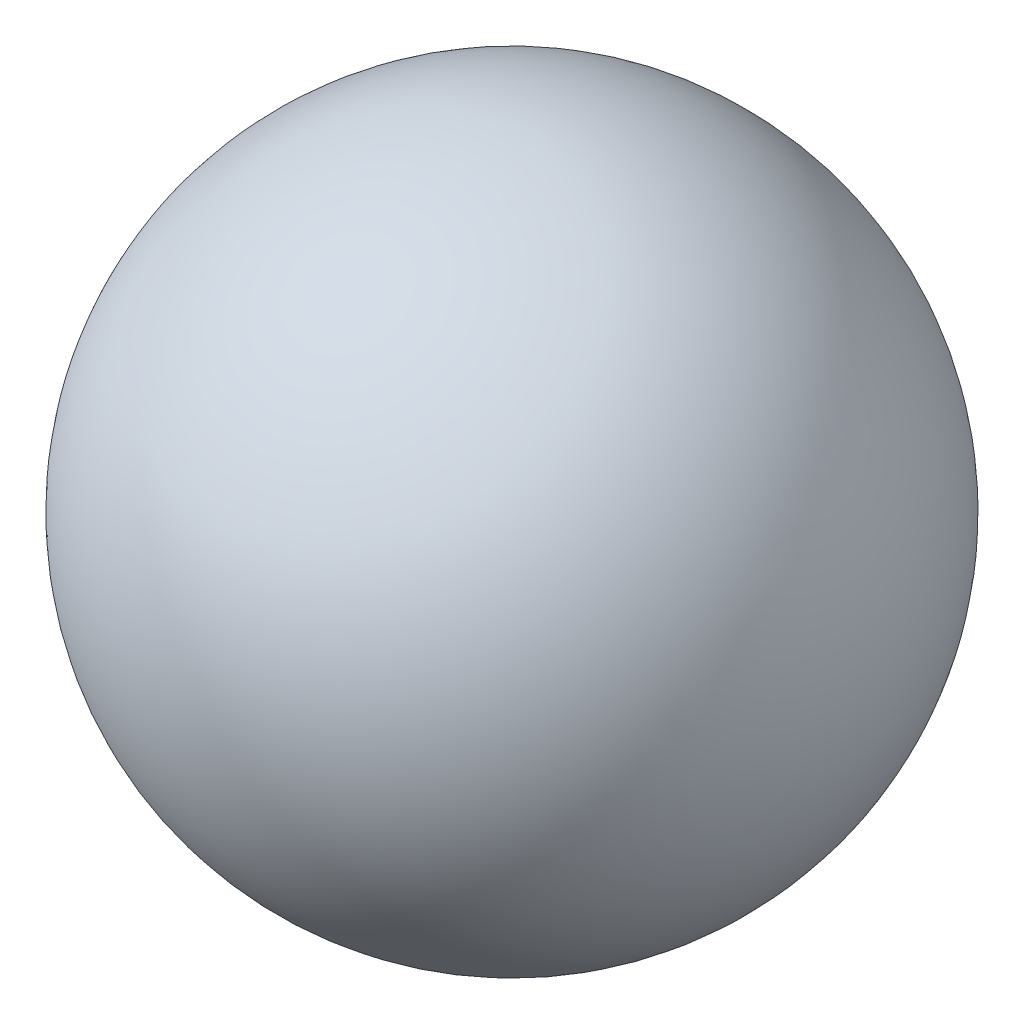
ISO-10303-21;
HEADER;
FILE_DESCRIPTION(('STEP AP214'),'2;1');
FILE_NAME('part.step','',(''),(''),'','','');
FILE_SCHEMA(('AUTOMOTIVE_DESIGN { 1 0 10303 214 1 1 1 1 }'));
ENDSEC;
DATA;
#1=APPLICATION_CONTEXT('core data for automotive mechanical design processes');
#2=APPLICATION_PROTOCOL_DEFINITION('international standard','automotive_design',2000,#1);
#3=PRODUCT_CONTEXT('',#1,'mechanical');
#4=PRODUCT('Part','Part','',(#3));
#5=PRODUCT_RELATED_PRODUCT_CATEGORY('part','',(#4));
#6=PRODUCT_DEFINITION_FORMATION('','',#4);
#7=PRODUCT_DEFINITION_CONTEXT('part definition',#1,'design');
#8=PRODUCT_DEFINITION('design','',#6,#7);
#9=PRODUCT_DEFINITION_SHAPE('','',#8);
#10=(LENGTH_UNIT() NAMED_UNIT(*) SI_UNIT(.MILLI.,.METRE.));
#11=(NAMED_UNIT(*) PLANE_ANGLE_UNIT() SI_UNIT($,.RADIAN.));
#12=(NAMED_UNIT(*) SI_UNIT($,.STERADIAN.) SOLID_ANGLE_UNIT());
#13=UNCERTAINTY_MEASURE_WITH_UNIT(LENGTH_MEASURE(1.E-05),#10,'distance_accuracy_value','');
#14=(GEOMETRIC_REPRESENTATION_CONTEXT(3) GLOBAL_UNCERTAINTY_ASSIGNED_CONTEXT((#13)) GLOBAL_UNIT_ASSIGNED_CONTEXT((#10,
#11,#12)) REPRESENTATION_CONTEXT('',''));
#15=CARTESIAN_POINT('',(0.,0.,0.));
#16=DIRECTION('',(0.,0.,1.));
#17=DIRECTION('',(1.,0.,0.));
#18=AXIS2_PLACEMENT_3D('',#15,#16,#17);
#19=CARTESIAN_POINT('',(0.,0.,0.));
#20=DIRECTION('',(-1.,0.,0.));
#21=DIRECTION('',(0.,-1.,0.));
#22=AXIS2_PLACEMENT_3D('',#19,#20,#21);
#23=SPHERICAL_SURFACE('',#22,12.);
#24=CARTESIAN_POINT('',(-12.,0.,0.));
#25=VERTEX_POINT('',#24);
#26=VERTEX_LOOP('',#25);
#27=FACE_BOUND('',#26,.T.);
#28=ADVANCED_FACE('F37',(#27),#23,.T.);
#29=CLOSED_SHELL('',(#28));
#30=MANIFOLD_SOLID_BREP('B2',#29);
#31=ADVANCED_BREP_SHAPE_REPRESENTATION('',(#18,#30),#14);
#32=SHAPE_DEFINITION_REPRESENTATION(#9,#31);
ENDSEC;
END-ISO-10303-21;
